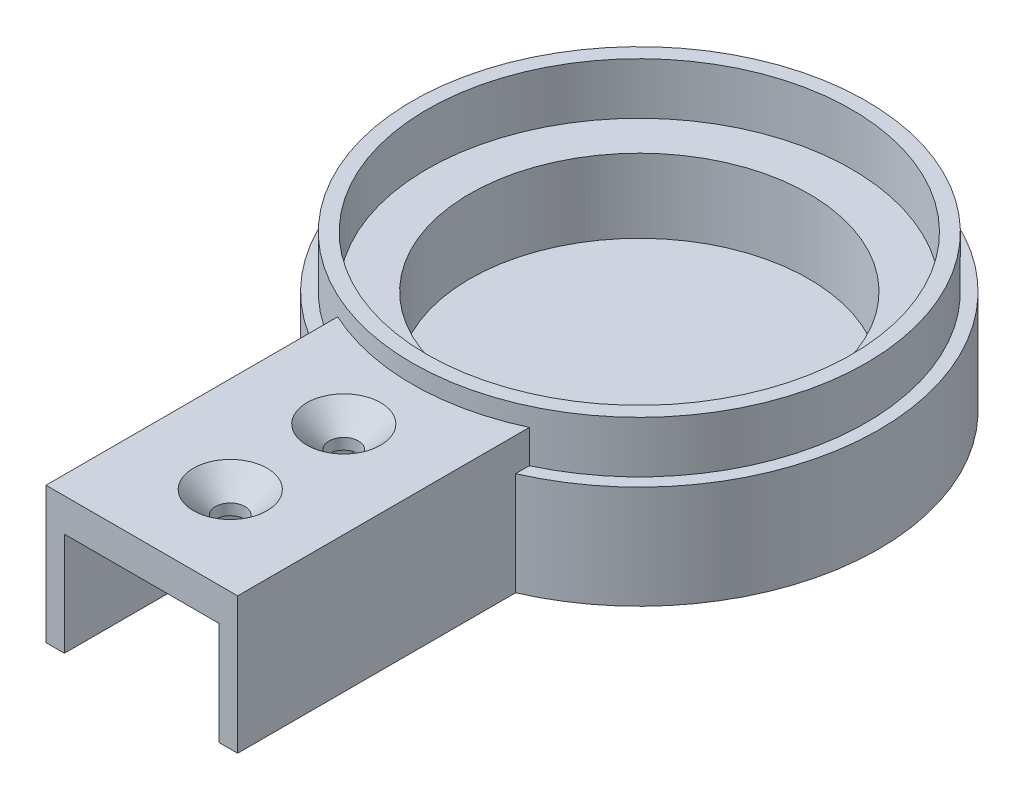
ISO-10303-21;
HEADER;
FILE_DESCRIPTION(('STEP AP214'),'2;1');
FILE_NAME('part.step','',(''),(''),'','','');
FILE_SCHEMA(('AUTOMOTIVE_DESIGN { 1 0 10303 214 1 1 1 1 }'));
ENDSEC;
DATA;
#1=APPLICATION_CONTEXT('core data for automotive mechanical design processes');
#2=APPLICATION_PROTOCOL_DEFINITION('international standard','automotive_design',2000,#1);
#3=PRODUCT_CONTEXT('',#1,'mechanical');
#4=PRODUCT('Part','Part','',(#3));
#5=PRODUCT_RELATED_PRODUCT_CATEGORY('part','',(#4));
#6=PRODUCT_DEFINITION_FORMATION('','',#4);
#7=PRODUCT_DEFINITION_CONTEXT('part definition',#1,'design');
#8=PRODUCT_DEFINITION('design','',#6,#7);
#9=PRODUCT_DEFINITION_SHAPE('','',#8);
#10=(LENGTH_UNIT() NAMED_UNIT(*) SI_UNIT(.MILLI.,.METRE.));
#11=(NAMED_UNIT(*) PLANE_ANGLE_UNIT() SI_UNIT($,.RADIAN.));
#12=(NAMED_UNIT(*) SI_UNIT($,.STERADIAN.) SOLID_ANGLE_UNIT());
#13=UNCERTAINTY_MEASURE_WITH_UNIT(LENGTH_MEASURE(1.E-05),#10,'distance_accuracy_value','');
#14=(GEOMETRIC_REPRESENTATION_CONTEXT(3) GLOBAL_UNCERTAINTY_ASSIGNED_CONTEXT((#13)) GLOBAL_UNIT_ASSIGNED_CONTEXT((#10,
#11,#12)) REPRESENTATION_CONTEXT('',''));
#15=CARTESIAN_POINT('',(0.,0.,0.));
#16=DIRECTION('',(0.,0.,1.));
#17=DIRECTION('',(1.,0.,0.));
#18=AXIS2_PLACEMENT_3D('',#15,#16,#17);
#19=CARTESIAN_POINT('',(0.,4.,0.));
#20=DIRECTION('',(0.,-1.,0.));
#21=DIRECTION('',(0.,0.,-1.));
#22=AXIS2_PLACEMENT_3D('',#19,#20,#21);
#23=CYLINDRICAL_SURFACE('',#22,32.5);
#24=CARTESIAN_POINT('',(0.,0.,0.));
#25=DIRECTION('',(0.,1.,0.));
#26=DIRECTION('',(0.,0.,1.));
#27=AXIS2_PLACEMENT_3D('',#24,#25,#26);
#28=CIRCLE('',#27,32.5);
#29=CARTESIAN_POINT('',(13.,0.,29.786742017213));
#30=VERTEX_POINT('',#29);
#31=CARTESIAN_POINT('',(-13.,0.,29.786742017213));
#32=VERTEX_POINT('',#31);
#33=EDGE_CURVE('E189',#30,#32,#28,.T.);
#34=ORIENTED_EDGE('',*,*,#33,.T.);
#35=DIRECTION('',(0.,-1.,0.));
#36=VECTOR('',#35,1.);
#37=CARTESIAN_POINT('',(-13.,4.,29.786742017213));
#38=LINE('',#37,#36);
#39=CARTESIAN_POINT('',(-13.,14.,29.786742017213));
#40=VERTEX_POINT('',#39);
#41=EDGE_CURVE('E252',#32,#40,#38,.F.);
#42=ORIENTED_EDGE('',*,*,#41,.T.);
#43=CARTESIAN_POINT('',(0.,14.,0.));
#44=DIRECTION('',(0.,1.,0.));
#45=DIRECTION('',(0.,0.,1.));
#46=AXIS2_PLACEMENT_3D('',#43,#44,#45);
#47=CIRCLE('',#46,32.5);
#48=CARTESIAN_POINT('',(13.,14.,29.786742017213));
#49=VERTEX_POINT('',#48);
#50=EDGE_CURVE('E310',#49,#40,#47,.T.);
#51=ORIENTED_EDGE('',*,*,#50,.F.);
#52=DIRECTION('',(0.,-1.,0.));
#53=VECTOR('',#52,1.);
#54=CARTESIAN_POINT('',(13.,4.,29.786742017213));
#55=LINE('',#54,#53);
#56=EDGE_CURVE('E281',#49,#30,#55,.T.);
#57=ORIENTED_EDGE('',*,*,#56,.T.);
#58=EDGE_LOOP('',(#34,#42,#51,#57));
#59=FACE_BOUND('',#58,.T.);
#60=ADVANCED_FACE('F37',(#59),#23,.T.);
#61=CARTESIAN_POINT('',(0.,14.,0.));
#62=DIRECTION('',(0.,1.,0.));
#63=DIRECTION('',(0.,0.,1.));
#64=AXIS2_PLACEMENT_3D('',#61,#62,#63);
#65=PLANE('',#64);
#66=DIRECTION('',(0.,0.,1.));
#67=VECTOR('',#66,1.);
#68=CARTESIAN_POINT('',(-13.,14.,0.));
#69=LINE('',#68,#67);
#70=CARTESIAN_POINT('',(-13.,14.,27.9220343098421));
#71=VERTEX_POINT('',#70);
#72=EDGE_CURVE('E293',#71,#40,#69,.T.);
#73=ORIENTED_EDGE('',*,*,#72,.F.);
#74=CARTESIAN_POINT('',(0.,14.,0.));
#75=DIRECTION('',(0.,1.,0.));
#76=DIRECTION('',(0.,0.,1.));
#77=AXIS2_PLACEMENT_3D('',#74,#75,#76);
#78=CIRCLE('',#77,30.8);
#79=CARTESIAN_POINT('',(13.,14.,27.9220343098421));
#80=VERTEX_POINT('',#79);
#81=EDGE_CURVE('E302',#80,#71,#78,.T.);
#82=ORIENTED_EDGE('',*,*,#81,.F.);
#83=DIRECTION('',(0.,0.,-1.));
#84=VECTOR('',#83,1.);
#85=CARTESIAN_POINT('',(13.,14.,0.));
#86=LINE('',#85,#84);
#87=EDGE_CURVE('E278',#49,#80,#86,.T.);
#88=ORIENTED_EDGE('',*,*,#87,.F.);
#89=ORIENTED_EDGE('',*,*,#50,.T.);
#90=EDGE_LOOP('',(#73,#82,#88,#89));
#91=FACE_BOUND('',#90,.T.);
#92=ADVANCED_FACE('F409',(#91),#65,.T.);
#93=DIRECTION('',(0.,-1.,0.));
#94=VECTOR('',#93,1.);
#95=CARTESIAN_POINT('',(-6.5,4.,31.8433666561813));
#96=LINE('',#95,#94);
#97=CARTESIAN_POINT('',(-6.5,12.,31.8433666561813));
#98=VERTEX_POINT('',#97);
#99=CARTESIAN_POINT('',(-6.5,4.,31.8433666561813));
#100=VERTEX_POINT('',#99);
#101=EDGE_CURVE('E205',#98,#100,#96,.T.);
#102=ORIENTED_EDGE('',*,*,#101,.T.);
#103=CARTESIAN_POINT('',(0.,4.,0.));
#104=DIRECTION('',(0.,-1.,0.));
#105=DIRECTION('',(0.,0.,-1.));
#106=AXIS2_PLACEMENT_3D('',#103,#104,#105);
#107=CIRCLE('',#106,32.5);
#108=CARTESIAN_POINT('',(-10.5,4.,30.7571129984594));
#109=VERTEX_POINT('',#108);
#110=EDGE_CURVE('E181',#100,#109,#107,.T.);
#111=ORIENTED_EDGE('',*,*,#110,.T.);
#112=DIRECTION('',(0.,-1.,0.));
#113=VECTOR('',#112,1.);
#114=CARTESIAN_POINT('',(-10.5,4.,30.7571129984594));
#115=LINE('',#114,#113);
#116=CARTESIAN_POINT('',(-10.5,0.,30.7571129984594));
#117=VERTEX_POINT('',#116);
#118=EDGE_CURVE('E287',#109,#117,#115,.T.);
#119=ORIENTED_EDGE('',*,*,#118,.T.);
#120=CARTESIAN_POINT('',(10.5,0.,30.7571129984594));
#121=VERTEX_POINT('',#120);
#122=EDGE_CURVE('E194',#117,#121,#28,.T.);
#123=ORIENTED_EDGE('',*,*,#122,.T.);
#124=DIRECTION('',(0.,-1.,0.));
#125=VECTOR('',#124,1.);
#126=CARTESIAN_POINT('',(10.5,4.,30.7571129984594));
#127=LINE('',#126,#125);
#128=CARTESIAN_POINT('',(10.5,4.,30.7571129984594));
#129=VERTEX_POINT('',#128);
#130=EDGE_CURVE('E284',#121,#129,#127,.F.);
#131=ORIENTED_EDGE('',*,*,#130,.T.);
#132=CARTESIAN_POINT('',(0.,4.,0.));
#133=DIRECTION('',(0.,-1.,0.));
#134=DIRECTION('',(0.,0.,-1.));
#135=AXIS2_PLACEMENT_3D('',#132,#133,#134);
#136=CIRCLE('',#135,32.5);
#137=CARTESIAN_POINT('',(6.5,4.,31.8433666561813));
#138=VERTEX_POINT('',#137);
#139=EDGE_CURVE('E368',#129,#138,#136,.T.);
#140=ORIENTED_EDGE('',*,*,#139,.T.);
#141=DIRECTION('',(0.,-1.,0.));
#142=VECTOR('',#141,1.);
#143=CARTESIAN_POINT('',(6.5,4.,31.8433666561813));
#144=LINE('',#143,#142);
#145=CARTESIAN_POINT('',(6.5,12.,31.8433666561813));
#146=VERTEX_POINT('',#145);
#147=EDGE_CURVE('E358',#138,#146,#144,.F.);
#148=ORIENTED_EDGE('',*,*,#147,.T.);
#149=CARTESIAN_POINT('',(0.,12.,0.));
#150=DIRECTION('',(0.,1.,0.));
#151=DIRECTION('',(-1.,0.,0.));
#152=AXIS2_PLACEMENT_3D('',#149,#150,#151);
#153=CIRCLE('',#152,32.5);
#154=CARTESIAN_POINT('',(10.5,12.,30.7571129984594));
#155=VERTEX_POINT('',#154);
#156=EDGE_CURVE('E365',#146,#155,#153,.T.);
#157=ORIENTED_EDGE('',*,*,#156,.T.);
#158=CARTESIAN_POINT('',(10.5,14.,30.7571129984594));
#159=VERTEX_POINT('',#158);
#160=EDGE_CURVE('E256',#155,#159,#127,.F.);
#161=ORIENTED_EDGE('',*,*,#160,.T.);
#162=CARTESIAN_POINT('',(0.,14.,0.));
#163=DIRECTION('',(0.,-1.,0.));
#164=DIRECTION('',(1.,0.,0.));
#165=AXIS2_PLACEMENT_3D('',#162,#163,#164);
#166=CIRCLE('',#165,32.5);
#167=CARTESIAN_POINT('',(-10.5,14.,30.7571129984594));
#168=VERTEX_POINT('',#167);
#169=EDGE_CURVE('E243',#159,#168,#166,.T.);
#170=ORIENTED_EDGE('',*,*,#169,.T.);
#171=CARTESIAN_POINT('',(-10.5,12.,30.7571129984594));
#172=VERTEX_POINT('',#171);
#173=EDGE_CURVE('E288',#168,#172,#115,.T.);
#174=ORIENTED_EDGE('',*,*,#173,.T.);
#175=CARTESIAN_POINT('',(0.,12.,0.));
#176=DIRECTION('',(0.,1.,0.));
#177=DIRECTION('',(0.,0.,1.));
#178=AXIS2_PLACEMENT_3D('',#175,#176,#177);
#179=CIRCLE('',#178,32.5);
#180=EDGE_CURVE('E362',#172,#98,#179,.T.);
#181=ORIENTED_EDGE('',*,*,#180,.T.);
#182=EDGE_LOOP('',(#102,#111,#119,#123,#131,#140,#148,#157,#161,#170,#174,#181));
#183=FACE_BOUND('',#182,.T.);
#184=ADVANCED_FACE('F318',(#183),#23,.T.);
#185=CARTESIAN_POINT('',(0.,0.,0.));
#186=DIRECTION('',(0.,1.,0.));
#187=DIRECTION('',(0.,0.,1.));
#188=AXIS2_PLACEMENT_3D('',#185,#186,#187);
#189=PLANE('',#188);
#190=ORIENTED_EDGE('',*,*,#122,.F.);
#191=DIRECTION('',(0.,0.,1.));
#192=VECTOR('',#191,1.);
#193=CARTESIAN_POINT('',(-10.5,0.,-32.501));
#194=LINE('',#193,#192);
#195=CARTESIAN_POINT('',(-10.5,0.,67.5));
#196=VERTEX_POINT('',#195);
#197=EDGE_CURVE('E263',#117,#196,#194,.T.);
#198=ORIENTED_EDGE('',*,*,#197,.T.);
#199=DIRECTION('',(1.,0.,0.));
#200=VECTOR('',#199,1.);
#201=CARTESIAN_POINT('',(-10.5,0.,67.5));
#202=LINE('',#201,#200);
#203=CARTESIAN_POINT('',(-13.,0.,67.5));
#204=VERTEX_POINT('',#203);
#205=EDGE_CURVE('E347',#204,#196,#202,.T.);
#206=ORIENTED_EDGE('',*,*,#205,.F.);
#207=DIRECTION('',(0.,0.,1.));
#208=VECTOR('',#207,1.);
#209=CARTESIAN_POINT('',(-13.,0.,-32.501));
#210=LINE('',#209,#208);
#211=EDGE_CURVE('E269',#32,#204,#210,.T.);
#212=ORIENTED_EDGE('',*,*,#211,.F.);
#213=ORIENTED_EDGE('',*,*,#33,.F.);
#214=DIRECTION('',(0.,0.,1.));
#215=VECTOR('',#214,1.);
#216=CARTESIAN_POINT('',(13.,0.,-32.501));
#217=LINE('',#216,#215);
#218=CARTESIAN_POINT('',(13.,0.,67.5));
#219=VERTEX_POINT('',#218);
#220=EDGE_CURVE('E261',#30,#219,#217,.T.);
#221=ORIENTED_EDGE('',*,*,#220,.T.);
#222=DIRECTION('',(1.,0.,0.));
#223=VECTOR('',#222,1.);
#224=CARTESIAN_POINT('',(13.,0.,67.5));
#225=LINE('',#224,#223);
#226=CARTESIAN_POINT('',(10.5,0.,67.5));
#227=VERTEX_POINT('',#226);
#228=EDGE_CURVE('E274',#227,#219,#225,.T.);
#229=ORIENTED_EDGE('',*,*,#228,.F.);
#230=DIRECTION('',(0.,0.,1.));
#231=VECTOR('',#230,1.);
#232=CARTESIAN_POINT('',(10.5,0.,-32.501));
#233=LINE('',#232,#231);
#234=EDGE_CURVE('E259',#121,#227,#233,.T.);
#235=ORIENTED_EDGE('',*,*,#234,.F.);
#236=EDGE_LOOP('',(#190,#198,#206,#212,#213,#221,#229,#235));
#237=FACE_BOUND('',#236,.T.);
#238=ADVANCED_FACE('F323',(#237),#189,.F.);
#239=CARTESIAN_POINT('',(0.,21.,0.));
#240=DIRECTION('',(0.,1.,0.));
#241=DIRECTION('',(0.,0.,1.));
#242=AXIS2_PLACEMENT_3D('',#239,#240,#241);
#243=PLANE('',#242);
#244=CARTESIAN_POINT('',(0.,21.,0.));
#245=DIRECTION('',(0.,1.,0.));
#246=DIRECTION('',(0.,0.,1.));
#247=AXIS2_PLACEMENT_3D('',#244,#245,#246);
#248=CIRCLE('',#247,30.8);
#249=CARTESIAN_POINT('',(0.,21.,30.8));
#250=VERTEX_POINT('',#249);
#251=EDGE_CURVE('E303',#250,#250,#248,.T.);
#252=ORIENTED_EDGE('',*,*,#251,.T.);
#253=EDGE_LOOP('',(#252));
#254=FACE_BOUND('',#253,.T.);
#255=CARTESIAN_POINT('',(0.,21.,0.));
#256=DIRECTION('',(0.,1.,0.));
#257=DIRECTION('',(0.,0.,1.));
#258=AXIS2_PLACEMENT_3D('',#255,#256,#257);
#259=CIRCLE('',#258,28.8);
#260=CARTESIAN_POINT('',(0.,21.,28.8));
#261=VERTEX_POINT('',#260);
#262=EDGE_CURVE('E299',#261,#261,#259,.T.);
#263=ORIENTED_EDGE('',*,*,#262,.F.);
#264=EDGE_LOOP('',(#263));
#265=FACE_BOUND('',#264,.T.);
#266=ADVANCED_FACE('F421',(#254,#265),#243,.T.);
#267=CARTESIAN_POINT('',(0.,21.,0.));
#268=DIRECTION('',(0.,-1.,0.));
#269=DIRECTION('',(0.,0.,-1.));
#270=AXIS2_PLACEMENT_3D('',#267,#268,#269);
#271=CYLINDRICAL_SURFACE('',#270,30.8);
#272=ORIENTED_EDGE('',*,*,#251,.F.);
#273=EDGE_LOOP('',(#272));
#274=FACE_BOUND('',#273,.T.);
#275=ORIENTED_EDGE('',*,*,#81,.T.);
#276=DIRECTION('',(0.,-1.,0.));
#277=VECTOR('',#276,1.);
#278=CARTESIAN_POINT('',(-13.,21.,27.9220343098421));
#279=LINE('',#278,#277);
#280=CARTESIAN_POINT('',(-13.,18.5,27.9220343098421));
#281=VERTEX_POINT('',#280);
#282=EDGE_CURVE('E290',#71,#281,#279,.F.);
#283=ORIENTED_EDGE('',*,*,#282,.T.);
#284=CARTESIAN_POINT('',(0.,18.5,0.));
#285=DIRECTION('',(0.,1.,0.));
#286=DIRECTION('',(-1.,0.,0.));
#287=AXIS2_PLACEMENT_3D('',#284,#285,#286);
#288=CIRCLE('',#287,30.8);
#289=CARTESIAN_POINT('',(13.,18.5,27.9220343098421));
#290=VERTEX_POINT('',#289);
#291=EDGE_CURVE('E251',#281,#290,#288,.T.);
#292=ORIENTED_EDGE('',*,*,#291,.T.);
#293=DIRECTION('',(0.,-1.,0.));
#294=VECTOR('',#293,1.);
#295=CARTESIAN_POINT('',(13.,21.,27.9220343098421));
#296=LINE('',#295,#294);
#297=EDGE_CURVE('E275',#290,#80,#296,.T.);
#298=ORIENTED_EDGE('',*,*,#297,.T.);
#299=EDGE_LOOP('',(#275,#283,#292,#298));
#300=FACE_BOUND('',#299,.T.);
#301=ADVANCED_FACE('F425',(#274,#300),#271,.T.);
#302=CARTESIAN_POINT('',(0.,21.,0.));
#303=DIRECTION('',(0.,-1.,0.));
#304=DIRECTION('',(0.,0.,-1.));
#305=AXIS2_PLACEMENT_3D('',#302,#303,#304);
#306=CYLINDRICAL_SURFACE('',#305,28.8);
#307=CARTESIAN_POINT('',(0.,14.,0.));
#308=DIRECTION('',(0.,1.,0.));
#309=DIRECTION('',(0.,0.,1.));
#310=AXIS2_PLACEMENT_3D('',#307,#308,#309);
#311=CIRCLE('',#310,28.8);
#312=CARTESIAN_POINT('',(0.,14.,28.8));
#313=VERTEX_POINT('',#312);
#314=EDGE_CURVE('E192',#313,#313,#311,.F.);
#315=ORIENTED_EDGE('',*,*,#314,.T.);
#316=EDGE_LOOP('',(#315));
#317=FACE_BOUND('',#316,.T.);
#318=ORIENTED_EDGE('',*,*,#262,.T.);
#319=EDGE_LOOP('',(#318));
#320=FACE_BOUND('',#319,.T.);
#321=ADVANCED_FACE('F430',(#317,#320),#306,.F.);
#322=CARTESIAN_POINT('',(0.,4.,0.));
#323=DIRECTION('',(0.,1.,0.));
#324=DIRECTION('',(0.,0.,1.));
#325=AXIS2_PLACEMENT_3D('',#322,#323,#324);
#326=PLANE('',#325);
#327=CARTESIAN_POINT('',(0.,4.,0.));
#328=DIRECTION('',(0.,1.,0.));
#329=DIRECTION('',(0.,0.,1.));
#330=AXIS2_PLACEMENT_3D('',#327,#328,#329);
#331=CIRCLE('',#330,23.);
#332=CARTESIAN_POINT('',(-10.5,4.,20.4633819296811));
#333=VERTEX_POINT('',#332);
#334=CARTESIAN_POINT('',(10.5,4.,20.4633819296811));
#335=VERTEX_POINT('',#334);
#336=EDGE_CURVE('E188',#333,#335,#331,.F.);
#337=ORIENTED_EDGE('',*,*,#336,.F.);
#338=DIRECTION('',(0.,0.,1.));
#339=VECTOR('',#338,1.);
#340=CARTESIAN_POINT('',(-10.5,4.,-32.501));
#341=LINE('',#340,#339);
#342=EDGE_CURVE('E60',#333,#109,#341,.T.);
#343=ORIENTED_EDGE('',*,*,#342,.T.);
#344=ORIENTED_EDGE('',*,*,#110,.F.);
#345=DIRECTION('',(0.,0.,1.));
#346=VECTOR('',#345,1.);
#347=CARTESIAN_POINT('',(-6.5,4.,-32.501));
#348=LINE('',#347,#346);
#349=CARTESIAN_POINT('',(-6.5,4.,22.0624114729102));
#350=VERTEX_POINT('',#349);
#351=EDGE_CURVE('E166',#350,#100,#348,.T.);
#352=ORIENTED_EDGE('',*,*,#351,.F.);
#353=CARTESIAN_POINT('',(6.5,4.,22.0624114729102));
#354=VERTEX_POINT('',#353);
#355=EDGE_CURVE('E179',#354,#350,#331,.F.);
#356=ORIENTED_EDGE('',*,*,#355,.F.);
#357=DIRECTION('',(0.,0.,1.));
#358=VECTOR('',#357,1.);
#359=CARTESIAN_POINT('',(6.5,4.,-32.501));
#360=LINE('',#359,#358);
#361=EDGE_CURVE('E374',#354,#138,#360,.T.);
#362=ORIENTED_EDGE('',*,*,#361,.T.);
#363=ORIENTED_EDGE('',*,*,#139,.F.);
#364=DIRECTION('',(0.,0.,1.));
#365=VECTOR('',#364,1.);
#366=CARTESIAN_POINT('',(10.5,4.,-32.501));
#367=LINE('',#366,#365);
#368=EDGE_CURVE('E376',#335,#129,#367,.T.);
#369=ORIENTED_EDGE('',*,*,#368,.F.);
#370=EDGE_LOOP('',(#337,#343,#344,#352,#356,#362,#363,#369));
#371=FACE_BOUND('',#370,.T.);
#372=ADVANCED_FACE('F177',(#371),#326,.T.);
#373=CARTESIAN_POINT('',(0.,14.,0.));
#374=DIRECTION('',(0.,-1.,0.));
#375=DIRECTION('',(0.,0.,-1.));
#376=AXIS2_PLACEMENT_3D('',#373,#374,#375);
#377=CYLINDRICAL_SURFACE('',#376,23.);
#378=DIRECTION('',(0.,-1.,0.));
#379=VECTOR('',#378,1.);
#380=CARTESIAN_POINT('',(-6.5,14.,22.0624114729102));
#381=LINE('',#380,#379);
#382=CARTESIAN_POINT('',(-6.5,12.,22.0624114729102));
#383=VERTEX_POINT('',#382);
#384=EDGE_CURVE('E163',#350,#383,#381,.F.);
#385=ORIENTED_EDGE('',*,*,#384,.T.);
#386=CARTESIAN_POINT('',(0.,12.,0.));
#387=DIRECTION('',(0.,1.,0.));
#388=DIRECTION('',(0.,0.,1.));
#389=AXIS2_PLACEMENT_3D('',#386,#387,#388);
#390=CIRCLE('',#389,23.);
#391=CARTESIAN_POINT('',(-10.5,12.,20.4633819296811));
#392=VERTEX_POINT('',#391);
#393=EDGE_CURVE('E385',#383,#392,#390,.F.);
#394=ORIENTED_EDGE('',*,*,#393,.T.);
#395=DIRECTION('',(0.,-1.,0.));
#396=VECTOR('',#395,1.);
#397=CARTESIAN_POINT('',(-10.5,14.,20.4633819296811));
#398=LINE('',#397,#396);
#399=EDGE_CURVE('E389',#392,#333,#398,.T.);
#400=ORIENTED_EDGE('',*,*,#399,.T.);
#401=ORIENTED_EDGE('',*,*,#336,.T.);
#402=DIRECTION('',(0.,-1.,0.));
#403=VECTOR('',#402,1.);
#404=CARTESIAN_POINT('',(10.5,14.,20.4633819296811));
#405=LINE('',#404,#403);
#406=CARTESIAN_POINT('',(10.5,12.,20.4633819296811));
#407=VERTEX_POINT('',#406);
#408=EDGE_CURVE('E378',#335,#407,#405,.F.);
#409=ORIENTED_EDGE('',*,*,#408,.T.);
#410=CARTESIAN_POINT('',(0.,12.,0.));
#411=DIRECTION('',(0.,1.,0.));
#412=DIRECTION('',(-1.,0.,0.));
#413=AXIS2_PLACEMENT_3D('',#410,#411,#412);
#414=CIRCLE('',#413,23.);
#415=CARTESIAN_POINT('',(6.5,12.,22.0624114729102));
#416=VERTEX_POINT('',#415);
#417=EDGE_CURVE('E373',#407,#416,#414,.F.);
#418=ORIENTED_EDGE('',*,*,#417,.T.);
#419=DIRECTION('',(0.,-1.,0.));
#420=VECTOR('',#419,1.);
#421=CARTESIAN_POINT('',(6.5,14.,22.0624114729102));
#422=LINE('',#421,#420);
#423=EDGE_CURVE('E187',#416,#354,#422,.T.);
#424=ORIENTED_EDGE('',*,*,#423,.T.);
#425=ORIENTED_EDGE('',*,*,#355,.T.);
#426=EDGE_LOOP('',(#385,#394,#400,#401,#409,#418,#424,#425));
#427=FACE_BOUND('',#426,.T.);
#428=CARTESIAN_POINT('',(0.,14.,0.));
#429=DIRECTION('',(0.,1.,0.));
#430=DIRECTION('',(0.,0.,1.));
#431=AXIS2_PLACEMENT_3D('',#428,#429,#430);
#432=CIRCLE('',#431,23.);
#433=CARTESIAN_POINT('',(0.,14.,23.));
#434=VERTEX_POINT('',#433);
#435=EDGE_CURVE('E306',#434,#434,#432,.T.);
#436=ORIENTED_EDGE('',*,*,#435,.T.);
#437=EDGE_LOOP('',(#436));
#438=FACE_BOUND('',#437,.T.);
#439=ADVANCED_FACE('F184',(#427,#438),#377,.F.);
#440=ORIENTED_EDGE('',*,*,#435,.F.);
#441=EDGE_LOOP('',(#440));
#442=FACE_BOUND('',#441,.T.);
#443=ORIENTED_EDGE('',*,*,#314,.F.);
#444=EDGE_LOOP('',(#443));
#445=FACE_BOUND('',#444,.T.);
#446=ADVANCED_FACE('F415',(#442,#445),#65,.T.);
#447=CARTESIAN_POINT('',(13.,18.5,-32.501));
#448=DIRECTION('',(0.,1.,0.));
#449=DIRECTION('',(-1.,0.,0.));
#450=AXIS2_PLACEMENT_3D('',#447,#448,#449);
#451=PLANE('',#450);
#452=CARTESIAN_POINT('',(0.,18.5,40.1));
#453=DIRECTION('',(0.,1.,0.));
#454=DIRECTION('',(-1.,0.,0.));
#455=AXIS2_PLACEMENT_3D('',#452,#453,#454);
#456=CIRCLE('',#455,5.00000000000002);
#457=CARTESIAN_POINT('',(-5.00000000000002,18.5,40.1));
#458=VERTEX_POINT('',#457);
#459=EDGE_CURVE('E45',#458,#458,#456,.F.);
#460=ORIENTED_EDGE('',*,*,#459,.T.);
#461=EDGE_LOOP('',(#460));
#462=FACE_BOUND('',#461,.T.);
#463=CARTESIAN_POINT('',(0.,18.5,55.5));
#464=DIRECTION('',(0.,1.,0.));
#465=DIRECTION('',(-1.,0.,0.));
#466=AXIS2_PLACEMENT_3D('',#463,#464,#465);
#467=CIRCLE('',#466,5.00000000000002);
#468=CARTESIAN_POINT('',(-5.00000000000002,18.5,55.5));
#469=VERTEX_POINT('',#468);
#470=EDGE_CURVE('E211',#469,#469,#467,.F.);
#471=ORIENTED_EDGE('',*,*,#470,.T.);
#472=EDGE_LOOP('',(#471));
#473=FACE_BOUND('',#472,.T.);
#474=ORIENTED_EDGE('',*,*,#291,.F.);
#475=DIRECTION('',(0.,0.,1.));
#476=VECTOR('',#475,1.);
#477=CARTESIAN_POINT('',(-13.,18.5,-32.501));
#478=LINE('',#477,#476);
#479=CARTESIAN_POINT('',(-13.,18.5,67.5));
#480=VERTEX_POINT('',#479);
#481=EDGE_CURVE('E272',#281,#480,#478,.T.);
#482=ORIENTED_EDGE('',*,*,#481,.T.);
#483=DIRECTION('',(-1.,0.,0.));
#484=VECTOR('',#483,1.);
#485=CARTESIAN_POINT('',(13.,18.5,67.5));
#486=LINE('',#485,#484);
#487=CARTESIAN_POINT('',(13.,18.5,67.5));
#488=VERTEX_POINT('',#487);
#489=EDGE_CURVE('E351',#488,#480,#486,.T.);
#490=ORIENTED_EDGE('',*,*,#489,.F.);
#491=DIRECTION('',(0.,0.,1.));
#492=VECTOR('',#491,1.);
#493=CARTESIAN_POINT('',(13.,18.5,-32.501));
#494=LINE('',#493,#492);
#495=EDGE_CURVE('E279',#290,#488,#494,.T.);
#496=ORIENTED_EDGE('',*,*,#495,.F.);
#497=EDGE_LOOP('',(#474,#482,#490,#496));
#498=FACE_BOUND('',#497,.T.);
#499=ADVANCED_FACE('F218',(#462,#473,#498),#451,.T.);
#500=CARTESIAN_POINT('',(-10.5,14.,-32.501));
#501=DIRECTION('',(0.,-1.,0.));
#502=DIRECTION('',(1.,0.,0.));
#503=AXIS2_PLACEMENT_3D('',#500,#501,#502);
#504=PLANE('',#503);
#505=CARTESIAN_POINT('',(0.,14.,55.5));
#506=DIRECTION('',(0.,-1.,0.));
#507=DIRECTION('',(1.,0.,0.));
#508=AXIS2_PLACEMENT_3D('',#505,#506,#507);
#509=CIRCLE('',#508,2.);
#510=CARTESIAN_POINT('',(2.,14.,55.5));
#511=VERTEX_POINT('',#510);
#512=EDGE_CURVE('E204',#511,#511,#509,.T.);
#513=ORIENTED_EDGE('',*,*,#512,.F.);
#514=EDGE_LOOP('',(#513));
#515=FACE_BOUND('',#514,.T.);
#516=CARTESIAN_POINT('',(0.,14.,40.1));
#517=DIRECTION('',(0.,-1.,0.));
#518=DIRECTION('',(1.,0.,0.));
#519=AXIS2_PLACEMENT_3D('',#516,#517,#518);
#520=CIRCLE('',#519,2.);
#521=CARTESIAN_POINT('',(2.,14.,40.1));
#522=VERTEX_POINT('',#521);
#523=EDGE_CURVE('E201',#522,#522,#520,.T.);
#524=ORIENTED_EDGE('',*,*,#523,.F.);
#525=EDGE_LOOP('',(#524));
#526=FACE_BOUND('',#525,.T.);
#527=ORIENTED_EDGE('',*,*,#169,.F.);
#528=DIRECTION('',(0.,0.,1.));
#529=VECTOR('',#528,1.);
#530=CARTESIAN_POINT('',(10.5,14.,-32.501));
#531=LINE('',#530,#529);
#532=CARTESIAN_POINT('',(10.5,14.,67.5));
#533=VERTEX_POINT('',#532);
#534=EDGE_CURVE('E246',#159,#533,#531,.T.);
#535=ORIENTED_EDGE('',*,*,#534,.T.);
#536=DIRECTION('',(1.,0.,0.));
#537=VECTOR('',#536,1.);
#538=CARTESIAN_POINT('',(-10.5,14.,67.5));
#539=LINE('',#538,#537);
#540=CARTESIAN_POINT('',(-10.5,14.,67.5));
#541=VERTEX_POINT('',#540);
#542=EDGE_CURVE('E332',#541,#533,#539,.T.);
#543=ORIENTED_EDGE('',*,*,#542,.F.);
#544=DIRECTION('',(0.,0.,1.));
#545=VECTOR('',#544,1.);
#546=CARTESIAN_POINT('',(-10.5,14.,-32.501));
#547=LINE('',#546,#545);
#548=EDGE_CURVE('E248',#168,#541,#547,.T.);
#549=ORIENTED_EDGE('',*,*,#548,.F.);
#550=EDGE_LOOP('',(#527,#535,#543,#549));
#551=FACE_BOUND('',#550,.T.);
#552=ADVANCED_FACE('F234',(#515,#526,#551),#504,.T.);
#553=CARTESIAN_POINT('',(-13.,18.5,-32.501));
#554=DIRECTION('',(-1.,0.,0.));
#555=DIRECTION('',(0.,-1.,0.));
#556=AXIS2_PLACEMENT_3D('',#553,#554,#555);
#557=PLANE('',#556);
#558=ORIENTED_EDGE('',*,*,#41,.F.);
#559=ORIENTED_EDGE('',*,*,#211,.T.);
#560=DIRECTION('',(0.,-1.,0.));
#561=VECTOR('',#560,1.);
#562=CARTESIAN_POINT('',(-13.,18.5,67.5));
#563=LINE('',#562,#561);
#564=EDGE_CURVE('E349',#480,#204,#563,.T.);
#565=ORIENTED_EDGE('',*,*,#564,.F.);
#566=ORIENTED_EDGE('',*,*,#481,.F.);
#567=ORIENTED_EDGE('',*,*,#282,.F.);
#568=ORIENTED_EDGE('',*,*,#72,.T.);
#569=EDGE_LOOP('',(#558,#559,#565,#566,#567,#568));
#570=FACE_BOUND('',#569,.T.);
#571=ADVANCED_FACE('F237',(#570),#557,.T.);
#572=CARTESIAN_POINT('',(-10.5,0.,-32.501));
#573=DIRECTION('',(1.,0.,0.));
#574=DIRECTION('',(0.,0.,-1.));
#575=AXIS2_PLACEMENT_3D('',#572,#573,#574);
#576=PLANE('',#575);
#577=ORIENTED_EDGE('',*,*,#118,.F.);
#578=ORIENTED_EDGE('',*,*,#342,.F.);
#579=ORIENTED_EDGE('',*,*,#399,.F.);
#580=DIRECTION('',(0.,0.,1.));
#581=VECTOR('',#580,1.);
#582=CARTESIAN_POINT('',(-10.5,12.,-32.501));
#583=LINE('',#582,#581);
#584=EDGE_CURVE('E387',#392,#172,#583,.T.);
#585=ORIENTED_EDGE('',*,*,#584,.T.);
#586=ORIENTED_EDGE('',*,*,#173,.F.);
#587=ORIENTED_EDGE('',*,*,#548,.T.);
#588=DIRECTION('',(0.,1.,0.));
#589=VECTOR('',#588,1.);
#590=CARTESIAN_POINT('',(-10.5,0.,67.5));
#591=LINE('',#590,#589);
#592=EDGE_CURVE('E335',#196,#541,#591,.T.);
#593=ORIENTED_EDGE('',*,*,#592,.F.);
#594=ORIENTED_EDGE('',*,*,#197,.F.);
#595=EDGE_LOOP('',(#577,#578,#579,#585,#586,#587,#593,#594));
#596=FACE_BOUND('',#595,.T.);
#597=ADVANCED_FACE('F441',(#596),#576,.T.);
#598=CARTESIAN_POINT('',(10.5,0.,-32.501));
#599=DIRECTION('',(-1.,0.,0.));
#600=DIRECTION('',(0.,-1.,0.));
#601=AXIS2_PLACEMENT_3D('',#598,#599,#600);
#602=PLANE('',#601);
#603=ORIENTED_EDGE('',*,*,#160,.F.);
#604=DIRECTION('',(0.,0.,1.));
#605=VECTOR('',#604,1.);
#606=CARTESIAN_POINT('',(10.5,12.,-32.501));
#607=LINE('',#606,#605);
#608=EDGE_CURVE('E52',#407,#155,#607,.T.);
#609=ORIENTED_EDGE('',*,*,#608,.F.);
#610=ORIENTED_EDGE('',*,*,#408,.F.);
#611=ORIENTED_EDGE('',*,*,#368,.T.);
#612=ORIENTED_EDGE('',*,*,#130,.F.);
#613=ORIENTED_EDGE('',*,*,#234,.T.);
#614=DIRECTION('',(0.,-1.,0.));
#615=VECTOR('',#614,1.);
#616=CARTESIAN_POINT('',(10.5,0.,67.5));
#617=LINE('',#616,#615);
#618=EDGE_CURVE('E258',#533,#227,#617,.T.);
#619=ORIENTED_EDGE('',*,*,#618,.F.);
#620=ORIENTED_EDGE('',*,*,#534,.F.);
#621=EDGE_LOOP('',(#603,#609,#610,#611,#612,#613,#619,#620));
#622=FACE_BOUND('',#621,.T.);
#623=ADVANCED_FACE('F255',(#622),#602,.T.);
#624=CARTESIAN_POINT('',(13.,18.5,-32.501));
#625=DIRECTION('',(1.,0.,0.));
#626=DIRECTION('',(0.,1.,0.));
#627=AXIS2_PLACEMENT_3D('',#624,#625,#626);
#628=PLANE('',#627);
#629=ORIENTED_EDGE('',*,*,#56,.F.);
#630=ORIENTED_EDGE('',*,*,#87,.T.);
#631=ORIENTED_EDGE('',*,*,#297,.F.);
#632=ORIENTED_EDGE('',*,*,#495,.T.);
#633=DIRECTION('',(0.,1.,0.));
#634=VECTOR('',#633,1.);
#635=CARTESIAN_POINT('',(13.,18.5,67.5));
#636=LINE('',#635,#634);
#637=EDGE_CURVE('E208',#219,#488,#636,.T.);
#638=ORIENTED_EDGE('',*,*,#637,.F.);
#639=ORIENTED_EDGE('',*,*,#220,.F.);
#640=EDGE_LOOP('',(#629,#630,#631,#632,#638,#639));
#641=FACE_BOUND('',#640,.T.);
#642=ADVANCED_FACE('F342',(#641),#628,.T.);
#643=CARTESIAN_POINT('',(0.,0.,67.5));
#644=DIRECTION('',(0.,0.,-1.));
#645=DIRECTION('',(-1.,0.,0.));
#646=AXIS2_PLACEMENT_3D('',#643,#644,#645);
#647=PLANE('',#646);
#648=ORIENTED_EDGE('',*,*,#637,.T.);
#649=ORIENTED_EDGE('',*,*,#489,.T.);
#650=ORIENTED_EDGE('',*,*,#564,.T.);
#651=ORIENTED_EDGE('',*,*,#205,.T.);
#652=ORIENTED_EDGE('',*,*,#592,.T.);
#653=ORIENTED_EDGE('',*,*,#542,.T.);
#654=ORIENTED_EDGE('',*,*,#618,.T.);
#655=ORIENTED_EDGE('',*,*,#228,.T.);
#656=EDGE_LOOP('',(#648,#649,#650,#651,#652,#653,#654,#655));
#657=FACE_BOUND('',#656,.T.);
#658=ADVANCED_FACE('F230',(#657),#647,.F.);
#659=CARTESIAN_POINT('',(0.,13.5,40.1));
#660=DIRECTION('',(0.,1.,0.));
#661=DIRECTION('',(-1.,0.,0.));
#662=AXIS2_PLACEMENT_3D('',#659,#660,#661);
#663=CYLINDRICAL_SURFACE('',#662,2.);
#664=CARTESIAN_POINT('',(0.,15.5,40.1));
#665=DIRECTION('',(0.,1.,0.));
#666=DIRECTION('',(-1.,0.,0.));
#667=AXIS2_PLACEMENT_3D('',#664,#665,#666);
#668=CIRCLE('',#667,2.);
#669=CARTESIAN_POINT('',(-2.00000000000001,15.5,40.1));
#670=VERTEX_POINT('',#669);
#671=EDGE_CURVE('E200',#670,#670,#668,.T.);
#672=ORIENTED_EDGE('',*,*,#671,.T.);
#673=EDGE_LOOP('',(#672));
#674=FACE_BOUND('',#673,.T.);
#675=ORIENTED_EDGE('',*,*,#523,.T.);
#676=EDGE_LOOP('',(#675));
#677=FACE_BOUND('',#676,.T.);
#678=ADVANCED_FACE('F227',(#674,#677),#663,.F.);
#679=CARTESIAN_POINT('',(0.,13.5,55.5));
#680=DIRECTION('',(0.,1.,0.));
#681=DIRECTION('',(-1.,0.,0.));
#682=AXIS2_PLACEMENT_3D('',#679,#680,#681);
#683=CYLINDRICAL_SURFACE('',#682,2.);
#684=CARTESIAN_POINT('',(0.,15.5,55.5));
#685=DIRECTION('',(0.,1.,0.));
#686=DIRECTION('',(-1.,0.,0.));
#687=AXIS2_PLACEMENT_3D('',#684,#685,#686);
#688=CIRCLE('',#687,2.);
#689=CARTESIAN_POINT('',(-2.00000000000001,15.5,55.5));
#690=VERTEX_POINT('',#689);
#691=EDGE_CURVE('E11',#690,#690,#688,.T.);
#692=ORIENTED_EDGE('',*,*,#691,.T.);
#693=EDGE_LOOP('',(#692));
#694=FACE_BOUND('',#693,.T.);
#695=ORIENTED_EDGE('',*,*,#512,.T.);
#696=EDGE_LOOP('',(#695));
#697=FACE_BOUND('',#696,.T.);
#698=ADVANCED_FACE('F224',(#694,#697),#683,.F.);
#699=CARTESIAN_POINT('',(0.,15.5,40.1));
#700=DIRECTION('',(0.,1.,0.));
#701=DIRECTION('',(-1.,0.,0.));
#702=AXIS2_PLACEMENT_3D('',#699,#700,#701);
#703=CONICAL_SURFACE('',#702,2.,0.785398163397452);
#704=ORIENTED_EDGE('',*,*,#459,.F.);
#705=EDGE_LOOP('',(#704));
#706=FACE_BOUND('',#705,.T.);
#707=ORIENTED_EDGE('',*,*,#671,.F.);
#708=EDGE_LOOP('',(#707));
#709=FACE_BOUND('',#708,.T.);
#710=ADVANCED_FACE('F221',(#706,#709),#703,.F.);
#711=CARTESIAN_POINT('',(0.,15.5,55.5));
#712=DIRECTION('',(0.,1.,0.));
#713=DIRECTION('',(-1.,0.,0.));
#714=AXIS2_PLACEMENT_3D('',#711,#712,#713);
#715=CONICAL_SURFACE('',#714,2.,0.785398163397452);
#716=ORIENTED_EDGE('',*,*,#470,.F.);
#717=EDGE_LOOP('',(#716));
#718=FACE_BOUND('',#717,.T.);
#719=ORIENTED_EDGE('',*,*,#691,.F.);
#720=EDGE_LOOP('',(#719));
#721=FACE_BOUND('',#720,.T.);
#722=ADVANCED_FACE('F39',(#718,#721),#715,.F.);
#723=CARTESIAN_POINT('',(6.5,4.,-32.501));
#724=DIRECTION('',(-1.,0.,0.));
#725=DIRECTION('',(0.,0.,1.));
#726=AXIS2_PLACEMENT_3D('',#723,#724,#725);
#727=PLANE('',#726);
#728=ORIENTED_EDGE('',*,*,#361,.F.);
#729=ORIENTED_EDGE('',*,*,#423,.F.);
#730=DIRECTION('',(0.,0.,1.));
#731=VECTOR('',#730,1.);
#732=CARTESIAN_POINT('',(6.5,12.,-32.501));
#733=LINE('',#732,#731);
#734=EDGE_CURVE('E370',#416,#146,#733,.T.);
#735=ORIENTED_EDGE('',*,*,#734,.T.);
#736=ORIENTED_EDGE('',*,*,#147,.F.);
#737=EDGE_LOOP('',(#728,#729,#735,#736));
#738=FACE_BOUND('',#737,.T.);
#739=ADVANCED_FACE('F398',(#738),#727,.F.);
#740=CARTESIAN_POINT('',(10.5,12.,-32.501));
#741=DIRECTION('',(0.,1.,0.));
#742=DIRECTION('',(-1.,0.,0.));
#743=AXIS2_PLACEMENT_3D('',#740,#741,#742);
#744=PLANE('',#743);
#745=ORIENTED_EDGE('',*,*,#734,.F.);
#746=ORIENTED_EDGE('',*,*,#417,.F.);
#747=ORIENTED_EDGE('',*,*,#608,.T.);
#748=ORIENTED_EDGE('',*,*,#156,.F.);
#749=EDGE_LOOP('',(#745,#746,#747,#748));
#750=FACE_BOUND('',#749,.T.);
#751=ADVANCED_FACE('F396',(#750),#744,.F.);
#752=CARTESIAN_POINT('',(-6.5,4.,-32.501));
#753=DIRECTION('',(1.,0.,0.));
#754=DIRECTION('',(0.,0.,-1.));
#755=AXIS2_PLACEMENT_3D('',#752,#753,#754);
#756=PLANE('',#755);
#757=DIRECTION('',(0.,0.,1.));
#758=VECTOR('',#757,1.);
#759=CARTESIAN_POINT('',(-6.5,12.,-32.501));
#760=LINE('',#759,#758);
#761=EDGE_CURVE('E169',#383,#98,#760,.T.);
#762=ORIENTED_EDGE('',*,*,#761,.F.);
#763=ORIENTED_EDGE('',*,*,#384,.F.);
#764=ORIENTED_EDGE('',*,*,#351,.T.);
#765=ORIENTED_EDGE('',*,*,#101,.F.);
#766=EDGE_LOOP('',(#762,#763,#764,#765));
#767=FACE_BOUND('',#766,.T.);
#768=ADVANCED_FACE('F165',(#767),#756,.F.);
#769=CARTESIAN_POINT('',(-10.5,12.,-32.501));
#770=DIRECTION('',(0.,1.,0.));
#771=DIRECTION('',(0.,0.,1.));
#772=AXIS2_PLACEMENT_3D('',#769,#770,#771);
#773=PLANE('',#772);
#774=ORIENTED_EDGE('',*,*,#584,.F.);
#775=ORIENTED_EDGE('',*,*,#393,.F.);
#776=ORIENTED_EDGE('',*,*,#761,.T.);
#777=ORIENTED_EDGE('',*,*,#180,.F.);
#778=EDGE_LOOP('',(#774,#775,#776,#777));
#779=FACE_BOUND('',#778,.T.);
#780=ADVANCED_FACE('F526',(#779),#773,.F.);
#781=CLOSED_SHELL('',(#60,#92,#184,#238,#266,#301,#321,#372,#439,#446,#499,#552,#571,#597,#623,
#642,#658,#678,#698,#710,#722,#739,#751,#768,#780));
#782=MANIFOLD_SOLID_BREP('B2',#781);
#783=ADVANCED_BREP_SHAPE_REPRESENTATION('',(#18,#782),#14);
#784=SHAPE_DEFINITION_REPRESENTATION(#9,#783);
ENDSEC;
END-ISO-10303-21;
